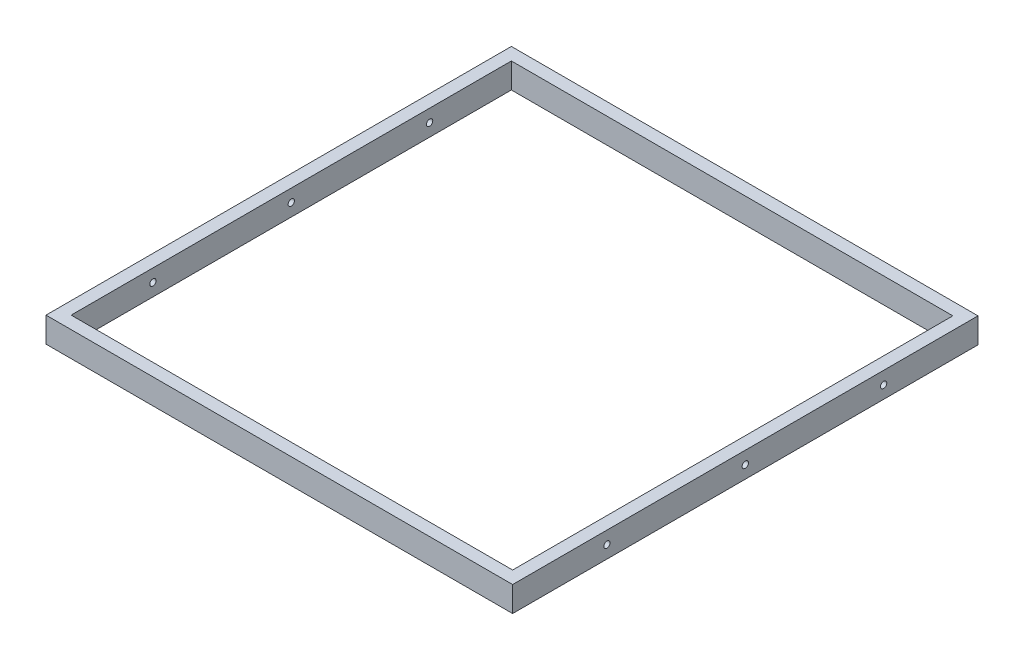
ISO-10303-21;
HEADER;
FILE_DESCRIPTION(('STEP AP214'),'2;1');
FILE_NAME('part.step','',(''),(''),'','','');
FILE_SCHEMA(('AUTOMOTIVE_DESIGN { 1 0 10303 214 1 1 1 1 }'));
ENDSEC;
DATA;
#1=APPLICATION_CONTEXT('core data for automotive mechanical design processes');
#2=APPLICATION_PROTOCOL_DEFINITION('international standard','automotive_design',2000,#1);
#3=PRODUCT_CONTEXT('',#1,'mechanical');
#4=PRODUCT('Part','Part','',(#3));
#5=PRODUCT_RELATED_PRODUCT_CATEGORY('part','',(#4));
#6=PRODUCT_DEFINITION_FORMATION('','',#4);
#7=PRODUCT_DEFINITION_CONTEXT('part definition',#1,'design');
#8=PRODUCT_DEFINITION('design','',#6,#7);
#9=PRODUCT_DEFINITION_SHAPE('','',#8);
#10=(LENGTH_UNIT() NAMED_UNIT(*) SI_UNIT(.MILLI.,.METRE.));
#11=(NAMED_UNIT(*) PLANE_ANGLE_UNIT() SI_UNIT($,.RADIAN.));
#12=(NAMED_UNIT(*) SI_UNIT($,.STERADIAN.) SOLID_ANGLE_UNIT());
#13=UNCERTAINTY_MEASURE_WITH_UNIT(LENGTH_MEASURE(1.E-05),#10,'distance_accuracy_value','');
#14=(GEOMETRIC_REPRESENTATION_CONTEXT(3) GLOBAL_UNCERTAINTY_ASSIGNED_CONTEXT((#13)) GLOBAL_UNIT_ASSIGNED_CONTEXT((#10,
#11,#12)) REPRESENTATION_CONTEXT('',''));
#15=CARTESIAN_POINT('',(0.,0.,0.));
#16=DIRECTION('',(0.,0.,1.));
#17=DIRECTION('',(1.,0.,0.));
#18=AXIS2_PLACEMENT_3D('',#15,#16,#17);
#19=CARTESIAN_POINT('',(0.,20.,0.));
#20=DIRECTION('',(0.,-1.,0.));
#21=DIRECTION('',(0.,0.,-1.));
#22=AXIS2_PLACEMENT_3D('',#19,#20,#21);
#23=PLANE('',#22);
#24=DIRECTION('',(0.,0.,1.));
#25=VECTOR('',#24,1.);
#26=CARTESIAN_POINT('',(-185.5,20.,185.));
#27=LINE('',#26,#25);
#28=CARTESIAN_POINT('',(-185.5,20.,-185.));
#29=VERTEX_POINT('',#28);
#30=CARTESIAN_POINT('',(-185.5,20.,185.));
#31=VERTEX_POINT('',#30);
#32=EDGE_CURVE('E137',#29,#31,#27,.T.);
#33=ORIENTED_EDGE('',*,*,#32,.T.);
#34=DIRECTION('',(1.,0.,0.));
#35=VECTOR('',#34,1.);
#36=CARTESIAN_POINT('',(-185.5,20.,185.));
#37=LINE('',#36,#35);
#38=CARTESIAN_POINT('',(185.5,20.,185.));
#39=VERTEX_POINT('',#38);
#40=EDGE_CURVE('E140',#31,#39,#37,.T.);
#41=ORIENTED_EDGE('',*,*,#40,.T.);
#42=DIRECTION('',(0.,0.,-1.));
#43=VECTOR('',#42,1.);
#44=CARTESIAN_POINT('',(185.5,20.,185.));
#45=LINE('',#44,#43);
#46=CARTESIAN_POINT('',(185.5,20.,-185.));
#47=VERTEX_POINT('',#46);
#48=EDGE_CURVE('E143',#39,#47,#45,.T.);
#49=ORIENTED_EDGE('',*,*,#48,.T.);
#50=DIRECTION('',(-1.,0.,0.));
#51=VECTOR('',#50,1.);
#52=CARTESIAN_POINT('',(-185.5,20.,-185.));
#53=LINE('',#52,#51);
#54=EDGE_CURVE('E145',#47,#29,#53,.T.);
#55=ORIENTED_EDGE('',*,*,#54,.T.);
#56=EDGE_LOOP('',(#33,#41,#49,#55));
#57=FACE_BOUND('',#56,.T.);
#58=DIRECTION('',(0.,0.,-1.));
#59=VECTOR('',#58,1.);
#60=CARTESIAN_POINT('',(175.5,20.,175.));
#61=LINE('',#60,#59);
#62=CARTESIAN_POINT('',(175.5,20.,175.));
#63=VERTEX_POINT('',#62);
#64=CARTESIAN_POINT('',(175.5,20.,-175.));
#65=VERTEX_POINT('',#64);
#66=EDGE_CURVE('E99',#63,#65,#61,.T.);
#67=ORIENTED_EDGE('',*,*,#66,.F.);
#68=DIRECTION('',(1.,0.,0.));
#69=VECTOR('',#68,1.);
#70=CARTESIAN_POINT('',(-175.5,20.,175.));
#71=LINE('',#70,#69);
#72=CARTESIAN_POINT('',(-175.5,20.,175.));
#73=VERTEX_POINT('',#72);
#74=EDGE_CURVE('E121',#73,#63,#71,.T.);
#75=ORIENTED_EDGE('',*,*,#74,.F.);
#76=DIRECTION('',(0.,0.,1.));
#77=VECTOR('',#76,1.);
#78=CARTESIAN_POINT('',(-175.5,20.,175.));
#79=LINE('',#78,#77);
#80=CARTESIAN_POINT('',(-175.5,20.,-175.));
#81=VERTEX_POINT('',#80);
#82=EDGE_CURVE('E119',#81,#73,#79,.T.);
#83=ORIENTED_EDGE('',*,*,#82,.F.);
#84=DIRECTION('',(-1.,0.,0.));
#85=VECTOR('',#84,1.);
#86=CARTESIAN_POINT('',(-175.5,20.,-175.));
#87=LINE('',#86,#85);
#88=EDGE_CURVE('E107',#65,#81,#87,.T.);
#89=ORIENTED_EDGE('',*,*,#88,.F.);
#90=EDGE_LOOP('',(#67,#75,#83,#89));
#91=FACE_BOUND('',#90,.T.);
#92=ADVANCED_FACE('F32',(#57,#91),#23,.F.);
#93=CARTESIAN_POINT('',(0.,0.,0.));
#94=DIRECTION('',(0.,-1.,0.));
#95=DIRECTION('',(0.,0.,-1.));
#96=AXIS2_PLACEMENT_3D('',#93,#94,#95);
#97=PLANE('',#96);
#98=DIRECTION('',(0.,0.,1.));
#99=VECTOR('',#98,1.);
#100=CARTESIAN_POINT('',(-185.5,0.,185.));
#101=LINE('',#100,#99);
#102=CARTESIAN_POINT('',(-185.5,0.,-185.));
#103=VERTEX_POINT('',#102);
#104=CARTESIAN_POINT('',(-185.5,0.,185.));
#105=VERTEX_POINT('',#104);
#106=EDGE_CURVE('E115',#103,#105,#101,.T.);
#107=ORIENTED_EDGE('',*,*,#106,.F.);
#108=DIRECTION('',(-1.,0.,0.));
#109=VECTOR('',#108,1.);
#110=CARTESIAN_POINT('',(-185.5,0.,-185.));
#111=LINE('',#110,#109);
#112=CARTESIAN_POINT('',(185.5,0.,-185.));
#113=VERTEX_POINT('',#112);
#114=EDGE_CURVE('E141',#113,#103,#111,.T.);
#115=ORIENTED_EDGE('',*,*,#114,.F.);
#116=DIRECTION('',(0.,0.,-1.));
#117=VECTOR('',#116,1.);
#118=CARTESIAN_POINT('',(185.5,0.,185.));
#119=LINE('',#118,#117);
#120=CARTESIAN_POINT('',(185.5,0.,185.));
#121=VERTEX_POINT('',#120);
#122=EDGE_CURVE('E152',#121,#113,#119,.T.);
#123=ORIENTED_EDGE('',*,*,#122,.F.);
#124=DIRECTION('',(1.,0.,0.));
#125=VECTOR('',#124,1.);
#126=CARTESIAN_POINT('',(-185.5,0.,185.));
#127=LINE('',#126,#125);
#128=EDGE_CURVE('E150',#105,#121,#127,.T.);
#129=ORIENTED_EDGE('',*,*,#128,.F.);
#130=EDGE_LOOP('',(#107,#115,#123,#129));
#131=FACE_BOUND('',#130,.T.);
#132=DIRECTION('',(1.,0.,0.));
#133=VECTOR('',#132,1.);
#134=CARTESIAN_POINT('',(-175.5,0.,175.));
#135=LINE('',#134,#133);
#136=CARTESIAN_POINT('',(-175.5,0.,175.));
#137=VERTEX_POINT('',#136);
#138=CARTESIAN_POINT('',(175.5,0.,175.));
#139=VERTEX_POINT('',#138);
#140=EDGE_CURVE('E108',#137,#139,#135,.T.);
#141=ORIENTED_EDGE('',*,*,#140,.T.);
#142=DIRECTION('',(0.,0.,-1.));
#143=VECTOR('',#142,1.);
#144=CARTESIAN_POINT('',(175.5,0.,175.));
#145=LINE('',#144,#143);
#146=CARTESIAN_POINT('',(175.5,0.,-175.));
#147=VERTEX_POINT('',#146);
#148=EDGE_CURVE('E57',#139,#147,#145,.T.);
#149=ORIENTED_EDGE('',*,*,#148,.T.);
#150=DIRECTION('',(-1.,0.,0.));
#151=VECTOR('',#150,1.);
#152=CARTESIAN_POINT('',(-175.5,0.,-175.));
#153=LINE('',#152,#151);
#154=CARTESIAN_POINT('',(-175.5,0.,-175.));
#155=VERTEX_POINT('',#154);
#156=EDGE_CURVE('E114',#147,#155,#153,.T.);
#157=ORIENTED_EDGE('',*,*,#156,.T.);
#158=DIRECTION('',(0.,0.,1.));
#159=VECTOR('',#158,1.);
#160=CARTESIAN_POINT('',(-175.5,0.,175.));
#161=LINE('',#160,#159);
#162=EDGE_CURVE('E129',#155,#137,#161,.T.);
#163=ORIENTED_EDGE('',*,*,#162,.T.);
#164=EDGE_LOOP('',(#141,#149,#157,#163));
#165=FACE_BOUND('',#164,.T.);
#166=ADVANCED_FACE('F210',(#131,#165),#97,.T.);
#167=CARTESIAN_POINT('',(-185.5,20.,185.));
#168=DIRECTION('',(1.,0.,0.));
#169=DIRECTION('',(0.,0.,-1.));
#170=AXIS2_PLACEMENT_3D('',#167,#168,#169);
#171=PLANE('',#170);
#172=CARTESIAN_POINT('',(-185.5,10.,110.));
#173=DIRECTION('',(1.,0.,0.));
#174=DIRECTION('',(0.,0.,-1.));
#175=AXIS2_PLACEMENT_3D('',#172,#173,#174);
#176=CIRCLE('',#175,2.49999999999999);
#177=CARTESIAN_POINT('',(-185.5,10.,107.5));
#178=VERTEX_POINT('',#177);
#179=EDGE_CURVE('E273',#178,#178,#176,.F.);
#180=ORIENTED_EDGE('',*,*,#179,.F.);
#181=EDGE_LOOP('',(#180));
#182=FACE_BOUND('',#181,.T.);
#183=CARTESIAN_POINT('',(-185.5,10.,-110.));
#184=DIRECTION('',(1.,0.,0.));
#185=DIRECTION('',(0.,0.,-1.));
#186=AXIS2_PLACEMENT_3D('',#183,#184,#185);
#187=CIRCLE('',#186,2.49999999999999);
#188=CARTESIAN_POINT('',(-185.5,10.,-112.5));
#189=VERTEX_POINT('',#188);
#190=EDGE_CURVE('E168',#189,#189,#187,.F.);
#191=ORIENTED_EDGE('',*,*,#190,.F.);
#192=EDGE_LOOP('',(#191));
#193=FACE_BOUND('',#192,.T.);
#194=CARTESIAN_POINT('',(-185.5,10.,0.));
#195=DIRECTION('',(1.,0.,0.));
#196=DIRECTION('',(0.,0.,-1.));
#197=AXIS2_PLACEMENT_3D('',#194,#195,#196);
#198=CIRCLE('',#197,2.5);
#199=CARTESIAN_POINT('',(-185.5,10.,-2.50000000000001));
#200=VERTEX_POINT('',#199);
#201=EDGE_CURVE('E164',#200,#200,#198,.F.);
#202=ORIENTED_EDGE('',*,*,#201,.F.);
#203=EDGE_LOOP('',(#202));
#204=FACE_BOUND('',#203,.T.);
#205=ORIENTED_EDGE('',*,*,#106,.T.);
#206=DIRECTION('',(0.,-1.,0.));
#207=VECTOR('',#206,1.);
#208=CARTESIAN_POINT('',(-185.5,20.,185.));
#209=LINE('',#208,#207);
#210=EDGE_CURVE('E11',#31,#105,#209,.T.);
#211=ORIENTED_EDGE('',*,*,#210,.F.);
#212=ORIENTED_EDGE('',*,*,#32,.F.);
#213=DIRECTION('',(0.,-1.,0.));
#214=VECTOR('',#213,1.);
#215=CARTESIAN_POINT('',(-185.5,20.,-185.));
#216=LINE('',#215,#214);
#217=EDGE_CURVE('E147',#29,#103,#216,.T.);
#218=ORIENTED_EDGE('',*,*,#217,.T.);
#219=EDGE_LOOP('',(#205,#211,#212,#218));
#220=FACE_BOUND('',#219,.T.);
#221=ADVANCED_FACE('F34',(#182,#193,#204,#220),#171,.F.);
#222=CARTESIAN_POINT('',(-185.5,20.,185.));
#223=DIRECTION('',(0.,0.,-1.));
#224=DIRECTION('',(-1.,0.,0.));
#225=AXIS2_PLACEMENT_3D('',#222,#223,#224);
#226=PLANE('',#225);
#227=ORIENTED_EDGE('',*,*,#128,.T.);
#228=DIRECTION('',(0.,-1.,0.));
#229=VECTOR('',#228,1.);
#230=CARTESIAN_POINT('',(185.5,20.,185.));
#231=LINE('',#230,#229);
#232=EDGE_CURVE('E41',#39,#121,#231,.T.);
#233=ORIENTED_EDGE('',*,*,#232,.F.);
#234=ORIENTED_EDGE('',*,*,#40,.F.);
#235=ORIENTED_EDGE('',*,*,#210,.T.);
#236=EDGE_LOOP('',(#227,#233,#234,#235));
#237=FACE_BOUND('',#236,.T.);
#238=ADVANCED_FACE('F219',(#237),#226,.F.);
#239=CARTESIAN_POINT('',(185.5,20.,185.));
#240=DIRECTION('',(-1.,0.,0.));
#241=DIRECTION('',(0.,0.,1.));
#242=AXIS2_PLACEMENT_3D('',#239,#240,#241);
#243=PLANE('',#242);
#244=CARTESIAN_POINT('',(185.5,10.,110.));
#245=DIRECTION('',(1.,0.,0.));
#246=DIRECTION('',(0.,0.,1.));
#247=AXIS2_PLACEMENT_3D('',#244,#245,#246);
#248=CIRCLE('',#247,2.49999999999999);
#249=CARTESIAN_POINT('',(185.5,10.,112.5));
#250=VERTEX_POINT('',#249);
#251=EDGE_CURVE('E274',#250,#250,#248,.T.);
#252=ORIENTED_EDGE('',*,*,#251,.F.);
#253=EDGE_LOOP('',(#252));
#254=FACE_BOUND('',#253,.T.);
#255=CARTESIAN_POINT('',(185.5,10.,-110.));
#256=DIRECTION('',(1.,0.,0.));
#257=DIRECTION('',(0.,0.,-1.));
#258=AXIS2_PLACEMENT_3D('',#255,#256,#257);
#259=CIRCLE('',#258,2.49999999999999);
#260=CARTESIAN_POINT('',(185.5,10.,-112.5));
#261=VERTEX_POINT('',#260);
#262=EDGE_CURVE('E175',#261,#261,#259,.T.);
#263=ORIENTED_EDGE('',*,*,#262,.F.);
#264=EDGE_LOOP('',(#263));
#265=FACE_BOUND('',#264,.T.);
#266=CARTESIAN_POINT('',(185.5,10.,0.));
#267=DIRECTION('',(1.,0.,0.));
#268=DIRECTION('',(0.,0.,-1.));
#269=AXIS2_PLACEMENT_3D('',#266,#267,#268);
#270=CIRCLE('',#269,2.5);
#271=CARTESIAN_POINT('',(185.5,10.,-2.50000000000001));
#272=VERTEX_POINT('',#271);
#273=EDGE_CURVE('E172',#272,#272,#270,.T.);
#274=ORIENTED_EDGE('',*,*,#273,.F.);
#275=EDGE_LOOP('',(#274));
#276=FACE_BOUND('',#275,.T.);
#277=ORIENTED_EDGE('',*,*,#122,.T.);
#278=DIRECTION('',(0.,-1.,0.));
#279=VECTOR('',#278,1.);
#280=CARTESIAN_POINT('',(185.5,20.,-185.));
#281=LINE('',#280,#279);
#282=EDGE_CURVE('E157',#47,#113,#281,.T.);
#283=ORIENTED_EDGE('',*,*,#282,.F.);
#284=ORIENTED_EDGE('',*,*,#48,.F.);
#285=ORIENTED_EDGE('',*,*,#232,.T.);
#286=EDGE_LOOP('',(#277,#283,#284,#285));
#287=FACE_BOUND('',#286,.T.);
#288=ADVANCED_FACE('F203',(#254,#265,#276,#287),#243,.F.);
#289=CARTESIAN_POINT('',(-185.5,20.,-185.));
#290=DIRECTION('',(0.,0.,1.));
#291=DIRECTION('',(1.,0.,0.));
#292=AXIS2_PLACEMENT_3D('',#289,#290,#291);
#293=PLANE('',#292);
#294=ORIENTED_EDGE('',*,*,#114,.T.);
#295=ORIENTED_EDGE('',*,*,#217,.F.);
#296=ORIENTED_EDGE('',*,*,#54,.F.);
#297=ORIENTED_EDGE('',*,*,#282,.T.);
#298=EDGE_LOOP('',(#294,#295,#296,#297));
#299=FACE_BOUND('',#298,.T.);
#300=ADVANCED_FACE('F194',(#299),#293,.F.);
#301=CARTESIAN_POINT('',(175.5,20.,175.));
#302=DIRECTION('',(-1.,0.,0.));
#303=DIRECTION('',(0.,0.,1.));
#304=AXIS2_PLACEMENT_3D('',#301,#302,#303);
#305=PLANE('',#304);
#306=CARTESIAN_POINT('',(175.5,10.,110.));
#307=DIRECTION('',(-1.,0.,0.));
#308=DIRECTION('',(0.,0.,1.));
#309=AXIS2_PLACEMENT_3D('',#306,#307,#308);
#310=CIRCLE('',#309,2.49999999999999);
#311=CARTESIAN_POINT('',(175.5,10.,112.5));
#312=VERTEX_POINT('',#311);
#313=EDGE_CURVE('E180',#312,#312,#310,.T.);
#314=ORIENTED_EDGE('',*,*,#313,.F.);
#315=EDGE_LOOP('',(#314));
#316=FACE_BOUND('',#315,.T.);
#317=CARTESIAN_POINT('',(175.5,10.,-110.));
#318=DIRECTION('',(-1.,0.,0.));
#319=DIRECTION('',(0.,0.,1.));
#320=AXIS2_PLACEMENT_3D('',#317,#318,#319);
#321=CIRCLE('',#320,2.49999999999999);
#322=CARTESIAN_POINT('',(175.5,10.,-107.5));
#323=VERTEX_POINT('',#322);
#324=EDGE_CURVE('E167',#323,#323,#321,.T.);
#325=ORIENTED_EDGE('',*,*,#324,.F.);
#326=EDGE_LOOP('',(#325));
#327=FACE_BOUND('',#326,.T.);
#328=CARTESIAN_POINT('',(175.5,10.,0.));
#329=DIRECTION('',(-1.,0.,0.));
#330=DIRECTION('',(0.,0.,1.));
#331=AXIS2_PLACEMENT_3D('',#328,#329,#330);
#332=CIRCLE('',#331,2.5);
#333=CARTESIAN_POINT('',(175.5,10.,2.5));
#334=VERTEX_POINT('',#333);
#335=EDGE_CURVE('E127',#334,#334,#332,.T.);
#336=ORIENTED_EDGE('',*,*,#335,.F.);
#337=EDGE_LOOP('',(#336));
#338=FACE_BOUND('',#337,.T.);
#339=ORIENTED_EDGE('',*,*,#148,.F.);
#340=DIRECTION('',(0.,-1.,0.));
#341=VECTOR('',#340,1.);
#342=CARTESIAN_POINT('',(175.5,20.,175.));
#343=LINE('',#342,#341);
#344=EDGE_CURVE('E103',#63,#139,#343,.T.);
#345=ORIENTED_EDGE('',*,*,#344,.F.);
#346=ORIENTED_EDGE('',*,*,#66,.T.);
#347=DIRECTION('',(0.,-1.,0.));
#348=VECTOR('',#347,1.);
#349=CARTESIAN_POINT('',(175.5,20.,-175.));
#350=LINE('',#349,#348);
#351=EDGE_CURVE('E102',#65,#147,#350,.T.);
#352=ORIENTED_EDGE('',*,*,#351,.T.);
#353=EDGE_LOOP('',(#339,#345,#346,#352));
#354=FACE_BOUND('',#353,.T.);
#355=ADVANCED_FACE('F101',(#316,#327,#338,#354),#305,.T.);
#356=CARTESIAN_POINT('',(-175.5,20.,-175.));
#357=DIRECTION('',(0.,0.,1.));
#358=DIRECTION('',(1.,0.,0.));
#359=AXIS2_PLACEMENT_3D('',#356,#357,#358);
#360=PLANE('',#359);
#361=ORIENTED_EDGE('',*,*,#156,.F.);
#362=ORIENTED_EDGE('',*,*,#351,.F.);
#363=ORIENTED_EDGE('',*,*,#88,.T.);
#364=DIRECTION('',(0.,-1.,0.));
#365=VECTOR('',#364,1.);
#366=CARTESIAN_POINT('',(-175.5,20.,-175.));
#367=LINE('',#366,#365);
#368=EDGE_CURVE('E116',#81,#155,#367,.T.);
#369=ORIENTED_EDGE('',*,*,#368,.T.);
#370=EDGE_LOOP('',(#361,#362,#363,#369));
#371=FACE_BOUND('',#370,.T.);
#372=ADVANCED_FACE('F111',(#371),#360,.T.);
#373=CARTESIAN_POINT('',(-175.5,20.,175.));
#374=DIRECTION('',(1.,0.,0.));
#375=DIRECTION('',(0.,0.,-1.));
#376=AXIS2_PLACEMENT_3D('',#373,#374,#375);
#377=PLANE('',#376);
#378=CARTESIAN_POINT('',(-175.5,10.,110.));
#379=DIRECTION('',(1.,0.,0.));
#380=DIRECTION('',(0.,0.,-1.));
#381=AXIS2_PLACEMENT_3D('',#378,#379,#380);
#382=CIRCLE('',#381,2.49999999999999);
#383=CARTESIAN_POINT('',(-175.5,10.,107.5));
#384=VERTEX_POINT('',#383);
#385=EDGE_CURVE('E36',#384,#384,#382,.T.);
#386=ORIENTED_EDGE('',*,*,#385,.F.);
#387=EDGE_LOOP('',(#386));
#388=FACE_BOUND('',#387,.T.);
#389=CARTESIAN_POINT('',(-175.5,10.,-110.));
#390=DIRECTION('',(1.,0.,0.));
#391=DIRECTION('',(0.,0.,-1.));
#392=AXIS2_PLACEMENT_3D('',#389,#390,#391);
#393=CIRCLE('',#392,2.49999999999999);
#394=CARTESIAN_POINT('',(-175.5,10.,-112.5));
#395=VERTEX_POINT('',#394);
#396=EDGE_CURVE('E165',#395,#395,#393,.T.);
#397=ORIENTED_EDGE('',*,*,#396,.F.);
#398=EDGE_LOOP('',(#397));
#399=FACE_BOUND('',#398,.T.);
#400=CARTESIAN_POINT('',(-175.5,10.,0.));
#401=DIRECTION('',(1.,0.,0.));
#402=DIRECTION('',(0.,0.,-1.));
#403=AXIS2_PLACEMENT_3D('',#400,#401,#402);
#404=CIRCLE('',#403,2.5);
#405=CARTESIAN_POINT('',(-175.5,10.,-2.50000000000001));
#406=VERTEX_POINT('',#405);
#407=EDGE_CURVE('E162',#406,#406,#404,.T.);
#408=ORIENTED_EDGE('',*,*,#407,.F.);
#409=EDGE_LOOP('',(#408));
#410=FACE_BOUND('',#409,.T.);
#411=ORIENTED_EDGE('',*,*,#162,.F.);
#412=ORIENTED_EDGE('',*,*,#368,.F.);
#413=ORIENTED_EDGE('',*,*,#82,.T.);
#414=DIRECTION('',(0.,-1.,0.));
#415=VECTOR('',#414,1.);
#416=CARTESIAN_POINT('',(-175.5,20.,175.));
#417=LINE('',#416,#415);
#418=EDGE_CURVE('E49',#73,#137,#417,.T.);
#419=ORIENTED_EDGE('',*,*,#418,.T.);
#420=EDGE_LOOP('',(#411,#412,#413,#419));
#421=FACE_BOUND('',#420,.T.);
#422=ADVANCED_FACE('F201',(#388,#399,#410,#421),#377,.T.);
#423=CARTESIAN_POINT('',(-175.5,20.,175.));
#424=DIRECTION('',(0.,0.,-1.));
#425=DIRECTION('',(-1.,0.,0.));
#426=AXIS2_PLACEMENT_3D('',#423,#424,#425);
#427=PLANE('',#426);
#428=ORIENTED_EDGE('',*,*,#140,.F.);
#429=ORIENTED_EDGE('',*,*,#418,.F.);
#430=ORIENTED_EDGE('',*,*,#74,.T.);
#431=ORIENTED_EDGE('',*,*,#344,.T.);
#432=EDGE_LOOP('',(#428,#429,#430,#431));
#433=FACE_BOUND('',#432,.T.);
#434=ADVANCED_FACE('F241',(#433),#427,.T.);
#435=CARTESIAN_POINT('',(-192.571067811865,10.,0.));
#436=DIRECTION('',(1.,0.,0.));
#437=DIRECTION('',(0.,0.,-1.));
#438=AXIS2_PLACEMENT_3D('',#435,#436,#437);
#439=CYLINDRICAL_SURFACE('',#438,2.5);
#440=ORIENTED_EDGE('',*,*,#407,.T.);
#441=EDGE_LOOP('',(#440));
#442=FACE_BOUND('',#441,.T.);
#443=ORIENTED_EDGE('',*,*,#201,.T.);
#444=EDGE_LOOP('',(#443));
#445=FACE_BOUND('',#444,.T.);
#446=ADVANCED_FACE('F243',(#442,#445),#439,.F.);
#447=ORIENTED_EDGE('',*,*,#335,.T.);
#448=EDGE_LOOP('',(#447));
#449=FACE_BOUND('',#448,.T.);
#450=ORIENTED_EDGE('',*,*,#273,.T.);
#451=EDGE_LOOP('',(#450));
#452=FACE_BOUND('',#451,.T.);
#453=ADVANCED_FACE('F190',(#449,#452),#439,.F.);
#454=CARTESIAN_POINT('',(-192.571067811865,10.,-110.));
#455=DIRECTION('',(1.,0.,0.));
#456=DIRECTION('',(0.,0.,-1.));
#457=AXIS2_PLACEMENT_3D('',#454,#455,#456);
#458=CYLINDRICAL_SURFACE('',#457,2.49999999999999);
#459=ORIENTED_EDGE('',*,*,#396,.T.);
#460=EDGE_LOOP('',(#459));
#461=FACE_BOUND('',#460,.T.);
#462=ORIENTED_EDGE('',*,*,#190,.T.);
#463=EDGE_LOOP('',(#462));
#464=FACE_BOUND('',#463,.T.);
#465=ADVANCED_FACE('F254',(#461,#464),#458,.F.);
#466=ORIENTED_EDGE('',*,*,#324,.T.);
#467=EDGE_LOOP('',(#466));
#468=FACE_BOUND('',#467,.T.);
#469=ORIENTED_EDGE('',*,*,#262,.T.);
#470=EDGE_LOOP('',(#469));
#471=FACE_BOUND('',#470,.T.);
#472=ADVANCED_FACE('F257',(#468,#471),#458,.F.);
#473=CARTESIAN_POINT('',(-192.571067811865,10.,110.));
#474=DIRECTION('',(1.,0.,0.));
#475=DIRECTION('',(0.,0.,-1.));
#476=AXIS2_PLACEMENT_3D('',#473,#474,#475);
#477=CYLINDRICAL_SURFACE('',#476,2.49999999999999);
#478=ORIENTED_EDGE('',*,*,#385,.T.);
#479=EDGE_LOOP('',(#478));
#480=FACE_BOUND('',#479,.T.);
#481=ORIENTED_EDGE('',*,*,#179,.T.);
#482=EDGE_LOOP('',(#481));
#483=FACE_BOUND('',#482,.T.);
#484=ADVANCED_FACE('F258',(#480,#483),#477,.F.);
#485=ORIENTED_EDGE('',*,*,#313,.T.);
#486=EDGE_LOOP('',(#485));
#487=FACE_BOUND('',#486,.T.);
#488=ORIENTED_EDGE('',*,*,#251,.T.);
#489=EDGE_LOOP('',(#488));
#490=FACE_BOUND('',#489,.T.);
#491=ADVANCED_FACE('F260',(#487,#490),#477,.F.);
#492=CLOSED_SHELL('',(#92,#166,#221,#238,#288,#300,#355,#372,#422,#434,#446,#453,#465,#472,#484,#491));
#493=MANIFOLD_SOLID_BREP('B2',#492);
#494=ADVANCED_BREP_SHAPE_REPRESENTATION('',(#18,#493),#14);
#495=SHAPE_DEFINITION_REPRESENTATION(#9,#494);
ENDSEC;
END-ISO-10303-21;
